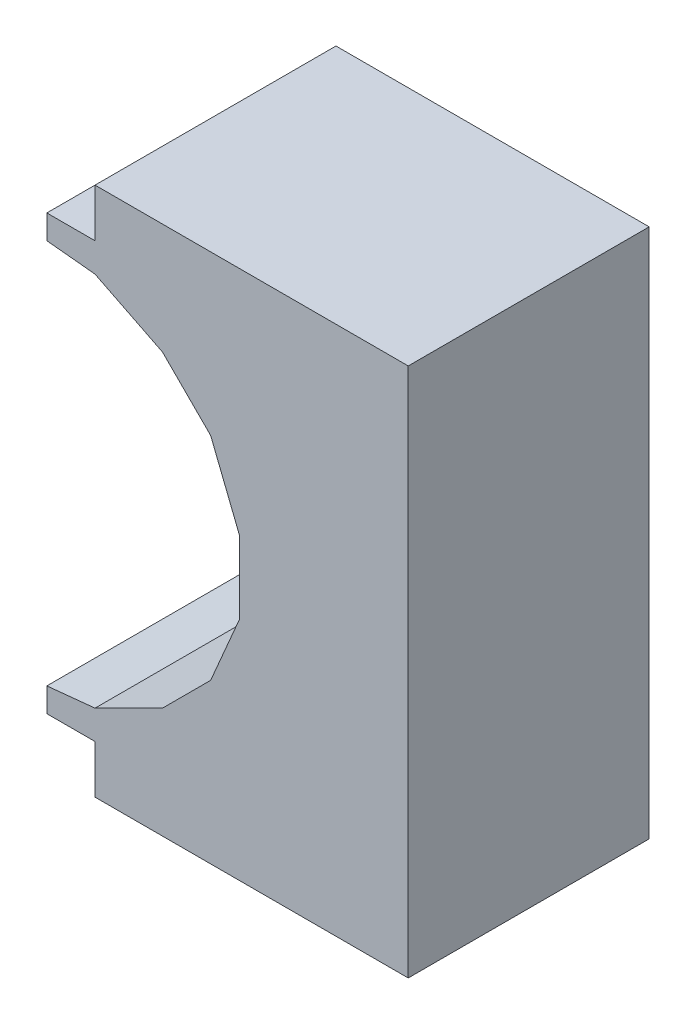
ISO-10303-21;
HEADER;
FILE_DESCRIPTION(('STEP AP214'),'2;1');
FILE_NAME('part.step','',(''),(''),'','','');
FILE_SCHEMA(('AUTOMOTIVE_DESIGN { 1 0 10303 214 1 1 1 1 }'));
ENDSEC;
DATA;
#1=APPLICATION_CONTEXT('core data for automotive mechanical design processes');
#2=APPLICATION_PROTOCOL_DEFINITION('international standard','automotive_design',2000,#1);
#3=PRODUCT_CONTEXT('',#1,'mechanical');
#4=PRODUCT('Part','Part','',(#3));
#5=PRODUCT_RELATED_PRODUCT_CATEGORY('part','',(#4));
#6=PRODUCT_DEFINITION_FORMATION('','',#4);
#7=PRODUCT_DEFINITION_CONTEXT('part definition',#1,'design');
#8=PRODUCT_DEFINITION('design','',#6,#7);
#9=PRODUCT_DEFINITION_SHAPE('','',#8);
#10=(LENGTH_UNIT() NAMED_UNIT(*) SI_UNIT(.MILLI.,.METRE.));
#11=(NAMED_UNIT(*) PLANE_ANGLE_UNIT() SI_UNIT($,.RADIAN.));
#12=(NAMED_UNIT(*) SI_UNIT($,.STERADIAN.) SOLID_ANGLE_UNIT());
#13=UNCERTAINTY_MEASURE_WITH_UNIT(LENGTH_MEASURE(1.E-05),#10,'distance_accuracy_value','');
#14=(GEOMETRIC_REPRESENTATION_CONTEXT(3) GLOBAL_UNCERTAINTY_ASSIGNED_CONTEXT((#13)) GLOBAL_UNIT_ASSIGNED_CONTEXT((#10,
#11,#12)) REPRESENTATION_CONTEXT('',''));
#15=CARTESIAN_POINT('',(0.,0.,0.));
#16=DIRECTION('',(0.,0.,1.));
#17=DIRECTION('',(1.,0.,0.));
#18=AXIS2_PLACEMENT_3D('',#15,#16,#17);
#19=CARTESIAN_POINT('',(-0.37499798,0.4499991,0.5));
#20=DIRECTION('',(0.,0.,-1.));
#21=DIRECTION('',(-1.,0.,0.));
#22=AXIS2_PLACEMENT_3D('',#19,#20,#21);
#23=PLANE('',#22);
#24=DIRECTION('',(0.995037190209989,-0.0995037190209989,0.));
#25=VECTOR('',#24,1.);
#26=CARTESIAN_POINT('',(-0.27499818,0.38999922,0.5));
#27=LINE('',#26,#25);
#28=CARTESIAN_POINT('',(-0.27499818,0.38999922,0.5));
#29=VERTEX_POINT('',#28);
#30=CARTESIAN_POINT('',(-0.37499798,0.3999992,0.5));
#31=VERTEX_POINT('',#30);
#32=EDGE_CURVE('E269',#29,#31,#27,.F.);
#33=ORIENTED_EDGE('',*,*,#32,.F.);
#34=DIRECTION('',(0.894427190999916,-0.447213595499958,0.));
#35=VECTOR('',#34,1.);
#36=CARTESIAN_POINT('',(-0.13499846,0.31999936,0.5));
#37=LINE('',#36,#35);
#38=CARTESIAN_POINT('',(-0.13499846,0.31999936,0.5));
#39=VERTEX_POINT('',#38);
#40=EDGE_CURVE('E262',#39,#29,#37,.F.);
#41=ORIENTED_EDGE('',*,*,#40,.F.);
#42=DIRECTION('',(0.707106781186548,-0.707106781186548,0.));
#43=VECTOR('',#42,1.);
#44=CARTESIAN_POINT('',(-0.03499866,0.21999956,0.5));
#45=LINE('',#44,#43);
#46=CARTESIAN_POINT('',(-0.03499866,0.21999956,0.5));
#47=VERTEX_POINT('',#46);
#48=EDGE_CURVE('E255',#47,#39,#45,.F.);
#49=ORIENTED_EDGE('',*,*,#48,.F.);
#50=DIRECTION('',(0.371390676354104,-0.928476690885259,0.));
#51=VECTOR('',#50,1.);
#52=CARTESIAN_POINT('',(0.02500122,0.06999986,0.5));
#53=LINE('',#52,#51);
#54=CARTESIAN_POINT('',(0.02500122,0.06999986,0.5));
#55=VERTEX_POINT('',#54);
#56=EDGE_CURVE('E248',#55,#47,#53,.F.);
#57=ORIENTED_EDGE('',*,*,#56,.F.);
#58=DIRECTION('',(0.,1.,0.));
#59=VECTOR('',#58,1.);
#60=CARTESIAN_POINT('',(0.02500122,-0.08000238,0.5));
#61=LINE('',#60,#59);
#62=CARTESIAN_POINT('',(0.0250012199999909,-0.080002379999996,0.5));
#63=VERTEX_POINT('',#62);
#64=EDGE_CURVE('E241',#63,#55,#61,.T.);
#65=ORIENTED_EDGE('',*,*,#64,.F.);
#66=DIRECTION('',(-0.393919298579047,-0.91914503001811,0.));
#67=VECTOR('',#66,1.);
#68=CARTESIAN_POINT('',(-0.03499866,-0.2200021,0.5));
#69=LINE('',#68,#67);
#70=CARTESIAN_POINT('',(-0.03499866,-0.2200021,0.5));
#71=VERTEX_POINT('',#70);
#72=EDGE_CURVE('E234',#71,#63,#69,.F.);
#73=ORIENTED_EDGE('',*,*,#72,.F.);
#74=DIRECTION('',(-0.707106781186548,-0.707106781186548,0.));
#75=VECTOR('',#74,1.);
#76=CARTESIAN_POINT('',(-0.13499846,-0.3200019,0.5));
#77=LINE('',#76,#75);
#78=CARTESIAN_POINT('',(-0.13499846,-0.3200019,0.5));
#79=VERTEX_POINT('',#78);
#80=EDGE_CURVE('E227',#79,#71,#77,.F.);
#81=ORIENTED_EDGE('',*,*,#80,.F.);
#82=DIRECTION('',(-0.894427190999916,-0.447213595499958,0.));
#83=VECTOR('',#82,1.);
#84=CARTESIAN_POINT('',(-0.27499818,-0.39000176,0.5));
#85=LINE('',#84,#83);
#86=CARTESIAN_POINT('',(-0.274998180000001,-0.390001759999997,0.5));
#87=VERTEX_POINT('',#86);
#88=EDGE_CURVE('E220',#87,#79,#85,.F.);
#89=ORIENTED_EDGE('',*,*,#88,.F.);
#90=DIRECTION('',(-0.995039692277377,-0.0994786951690777,0.));
#91=VECTOR('',#90,1.);
#92=CARTESIAN_POINT('',(-0.37499798,-0.3999992,0.5));
#93=LINE('',#92,#91);
#94=CARTESIAN_POINT('',(-0.37499798,-0.3999992,0.5));
#95=VERTEX_POINT('',#94);
#96=EDGE_CURVE('E213',#95,#87,#93,.F.);
#97=ORIENTED_EDGE('',*,*,#96,.F.);
#98=DIRECTION('',(0.,1.,0.));
#99=VECTOR('',#98,1.);
#100=CARTESIAN_POINT('',(-0.37499798,-0.45000164,0.5));
#101=LINE('',#100,#99);
#102=CARTESIAN_POINT('',(-0.37499798,-0.45000164,0.5));
#103=VERTEX_POINT('',#102);
#104=EDGE_CURVE('E206',#103,#95,#101,.T.);
#105=ORIENTED_EDGE('',*,*,#104,.F.);
#106=DIRECTION('',(1.,0.,0.));
#107=VECTOR('',#106,1.);
#108=CARTESIAN_POINT('',(-0.27499818,-0.45000164,0.5));
#109=LINE('',#108,#107);
#110=CARTESIAN_POINT('',(-0.27499818,-0.45000164,0.5));
#111=VERTEX_POINT('',#110);
#112=EDGE_CURVE('E199',#111,#103,#109,.F.);
#113=ORIENTED_EDGE('',*,*,#112,.F.);
#114=DIRECTION('',(0.,1.,0.));
#115=VECTOR('',#114,1.);
#116=CARTESIAN_POINT('',(-0.27499818,-0.55000144,0.5));
#117=LINE('',#116,#115);
#118=CARTESIAN_POINT('',(-0.27499818,-0.55000144,0.5));
#119=VERTEX_POINT('',#118);
#120=EDGE_CURVE('E192',#119,#111,#117,.T.);
#121=ORIENTED_EDGE('',*,*,#120,.F.);
#122=DIRECTION('',(1.,0.,0.));
#123=VECTOR('',#122,1.);
#124=CARTESIAN_POINT('',(0.37500052,-0.55000144,0.5));
#125=LINE('',#124,#123);
#126=CARTESIAN_POINT('',(0.37500052,-0.55000144,0.5));
#127=VERTEX_POINT('',#126);
#128=EDGE_CURVE('E185',#127,#119,#125,.F.);
#129=ORIENTED_EDGE('',*,*,#128,.F.);
#130=DIRECTION('',(0.,1.,0.));
#131=VECTOR('',#130,1.);
#132=CARTESIAN_POINT('',(0.37500052,0.55000144,0.5));
#133=LINE('',#132,#131);
#134=CARTESIAN_POINT('',(0.37500052,0.55000144,0.5));
#135=VERTEX_POINT('',#134);
#136=EDGE_CURVE('E178',#135,#127,#133,.F.);
#137=ORIENTED_EDGE('',*,*,#136,.F.);
#138=DIRECTION('',(1.,0.,0.));
#139=VECTOR('',#138,1.);
#140=CARTESIAN_POINT('',(-0.27499818,0.55000144,0.5));
#141=LINE('',#140,#139);
#142=CARTESIAN_POINT('',(-0.27499818,0.55000144,0.5));
#143=VERTEX_POINT('',#142);
#144=EDGE_CURVE('E155',#143,#135,#141,.T.);
#145=ORIENTED_EDGE('',*,*,#144,.F.);
#146=DIRECTION('',(0.,1.,0.));
#147=VECTOR('',#146,1.);
#148=CARTESIAN_POINT('',(-0.27499818,0.4499991,0.5));
#149=LINE('',#148,#147);
#150=CARTESIAN_POINT('',(-0.27499818,0.4499991,0.5));
#151=VERTEX_POINT('',#150);
#152=EDGE_CURVE('E139',#151,#143,#149,.T.);
#153=ORIENTED_EDGE('',*,*,#152,.F.);
#154=DIRECTION('',(1.,0.,0.));
#155=VECTOR('',#154,1.);
#156=CARTESIAN_POINT('',(-0.37499798,0.4499991,0.5));
#157=LINE('',#156,#155);
#158=CARTESIAN_POINT('',(-0.37499798,0.4499991,0.5));
#159=VERTEX_POINT('',#158);
#160=EDGE_CURVE('E19',#159,#151,#157,.T.);
#161=ORIENTED_EDGE('',*,*,#160,.F.);
#162=DIRECTION('',(0.,1.,0.));
#163=VECTOR('',#162,1.);
#164=CARTESIAN_POINT('',(-0.37499798,0.3999992,0.5));
#165=LINE('',#164,#163);
#166=EDGE_CURVE('E274',#31,#159,#165,.T.);
#167=ORIENTED_EDGE('',*,*,#166,.F.);
#168=EDGE_LOOP('',(#33,#41,#49,#57,#65,#73,#81,#89,#97,#105,#113,#121,#129,#137,#145,#153,#161,#167));
#169=FACE_BOUND('',#168,.T.);
#170=ADVANCED_FACE('F16',(#169),#23,.F.);
#171=CARTESIAN_POINT('',(-0.37499798,0.4499991,0.));
#172=DIRECTION('',(0.,1.,0.));
#173=DIRECTION('',(0.,0.,1.));
#174=AXIS2_PLACEMENT_3D('',#171,#172,#173);
#175=PLANE('',#174);
#176=DIRECTION('',(0.,0.,1.));
#177=VECTOR('',#176,1.);
#178=CARTESIAN_POINT('',(-0.27499818,0.4499991,0.));
#179=LINE('',#178,#177);
#180=CARTESIAN_POINT('',(-0.27499818,0.4499991,0.));
#181=VERTEX_POINT('',#180);
#182=EDGE_CURVE('E145',#181,#151,#179,.T.);
#183=ORIENTED_EDGE('',*,*,#182,.F.);
#184=DIRECTION('',(-1.,0.,0.));
#185=VECTOR('',#184,1.);
#186=CARTESIAN_POINT('',(-0.37499798,0.4499991,0.));
#187=LINE('',#186,#185);
#188=CARTESIAN_POINT('',(-0.37499798,0.4499991,0.));
#189=VERTEX_POINT('',#188);
#190=EDGE_CURVE('E279',#189,#181,#187,.F.);
#191=ORIENTED_EDGE('',*,*,#190,.F.);
#192=DIRECTION('',(0.,0.,1.));
#193=VECTOR('',#192,1.);
#194=CARTESIAN_POINT('',(-0.37499798,0.4499991,0.));
#195=LINE('',#194,#193);
#196=EDGE_CURVE('E148',#159,#189,#195,.F.);
#197=ORIENTED_EDGE('',*,*,#196,.F.);
#198=ORIENTED_EDGE('',*,*,#160,.T.);
#199=EDGE_LOOP('',(#183,#191,#197,#198));
#200=FACE_BOUND('',#199,.T.);
#201=ADVANCED_FACE('F144',(#200),#175,.T.);
#202=CARTESIAN_POINT('',(-0.27499818,0.4499991,0.));
#203=DIRECTION('',(-1.,0.,0.));
#204=DIRECTION('',(0.,0.,1.));
#205=AXIS2_PLACEMENT_3D('',#202,#203,#204);
#206=PLANE('',#205);
#207=DIRECTION('',(0.,0.,1.));
#208=VECTOR('',#207,1.);
#209=CARTESIAN_POINT('',(-0.27499818,0.55000144,0.));
#210=LINE('',#209,#208);
#211=CARTESIAN_POINT('',(-0.27499818,0.55000144,0.));
#212=VERTEX_POINT('',#211);
#213=EDGE_CURVE('E158',#212,#143,#210,.T.);
#214=ORIENTED_EDGE('',*,*,#213,.F.);
#215=DIRECTION('',(0.,1.,0.));
#216=VECTOR('',#215,1.);
#217=CARTESIAN_POINT('',(-0.27499818,0.4499991,0.));
#218=LINE('',#217,#216);
#219=EDGE_CURVE('E162',#181,#212,#218,.T.);
#220=ORIENTED_EDGE('',*,*,#219,.F.);
#221=ORIENTED_EDGE('',*,*,#182,.T.);
#222=ORIENTED_EDGE('',*,*,#152,.T.);
#223=EDGE_LOOP('',(#214,#220,#221,#222));
#224=FACE_BOUND('',#223,.T.);
#225=ADVANCED_FACE('F160',(#224),#206,.T.);
#226=CARTESIAN_POINT('',(-0.27499818,0.55000144,0.));
#227=DIRECTION('',(0.,1.,0.));
#228=DIRECTION('',(0.,0.,1.));
#229=AXIS2_PLACEMENT_3D('',#226,#227,#228);
#230=PLANE('',#229);
#231=DIRECTION('',(0.,0.,-1.));
#232=VECTOR('',#231,1.);
#233=CARTESIAN_POINT('',(0.37500052,0.55000144,0.));
#234=LINE('',#233,#232);
#235=CARTESIAN_POINT('',(0.37500052,0.55000144,0.));
#236=VERTEX_POINT('',#235);
#237=EDGE_CURVE('E174',#236,#135,#234,.F.);
#238=ORIENTED_EDGE('',*,*,#237,.F.);
#239=DIRECTION('',(-1.,0.,0.));
#240=VECTOR('',#239,1.);
#241=CARTESIAN_POINT('',(-0.37499798,0.55000144,0.));
#242=LINE('',#241,#240);
#243=EDGE_CURVE('E283',#212,#236,#242,.F.);
#244=ORIENTED_EDGE('',*,*,#243,.F.);
#245=ORIENTED_EDGE('',*,*,#213,.T.);
#246=ORIENTED_EDGE('',*,*,#144,.T.);
#247=EDGE_LOOP('',(#238,#244,#245,#246));
#248=FACE_BOUND('',#247,.T.);
#249=ADVANCED_FACE('F411',(#248),#230,.T.);
#250=CARTESIAN_POINT('',(0.37500052,0.55000144,0.));
#251=DIRECTION('',(1.,0.,0.));
#252=DIRECTION('',(0.,0.,-1.));
#253=AXIS2_PLACEMENT_3D('',#250,#251,#252);
#254=PLANE('',#253);
#255=DIRECTION('',(0.,0.,-1.));
#256=VECTOR('',#255,1.);
#257=CARTESIAN_POINT('',(0.37500052,-0.55000144,0.));
#258=LINE('',#257,#256);
#259=CARTESIAN_POINT('',(0.37500052,-0.55000144,0.));
#260=VERTEX_POINT('',#259);
#261=EDGE_CURVE('E181',#260,#127,#258,.F.);
#262=ORIENTED_EDGE('',*,*,#261,.F.);
#263=DIRECTION('',(0.,1.,0.));
#264=VECTOR('',#263,1.);
#265=CARTESIAN_POINT('',(0.37500052,0.4499991,0.));
#266=LINE('',#265,#264);
#267=EDGE_CURVE('E287',#236,#260,#266,.F.);
#268=ORIENTED_EDGE('',*,*,#267,.F.);
#269=ORIENTED_EDGE('',*,*,#237,.T.);
#270=ORIENTED_EDGE('',*,*,#136,.T.);
#271=EDGE_LOOP('',(#262,#268,#269,#270));
#272=FACE_BOUND('',#271,.T.);
#273=ADVANCED_FACE('F407',(#272),#254,.T.);
#274=CARTESIAN_POINT('',(0.37500052,-0.55000144,0.));
#275=DIRECTION('',(0.,-1.,0.));
#276=DIRECTION('',(0.,0.,-1.));
#277=AXIS2_PLACEMENT_3D('',#274,#275,#276);
#278=PLANE('',#277);
#279=DIRECTION('',(0.,0.,1.));
#280=VECTOR('',#279,1.);
#281=CARTESIAN_POINT('',(-0.27499818,-0.55000144,0.));
#282=LINE('',#281,#280);
#283=CARTESIAN_POINT('',(-0.27499818,-0.55000144,0.));
#284=VERTEX_POINT('',#283);
#285=EDGE_CURVE('E188',#284,#119,#282,.T.);
#286=ORIENTED_EDGE('',*,*,#285,.F.);
#287=DIRECTION('',(-1.,0.,0.));
#288=VECTOR('',#287,1.);
#289=CARTESIAN_POINT('',(-0.37499798,-0.55000144,0.));
#290=LINE('',#289,#288);
#291=EDGE_CURVE('E291',#260,#284,#290,.T.);
#292=ORIENTED_EDGE('',*,*,#291,.F.);
#293=ORIENTED_EDGE('',*,*,#261,.T.);
#294=ORIENTED_EDGE('',*,*,#128,.T.);
#295=EDGE_LOOP('',(#286,#292,#293,#294));
#296=FACE_BOUND('',#295,.T.);
#297=ADVANCED_FACE('F403',(#296),#278,.T.);
#298=CARTESIAN_POINT('',(-0.27499818,-0.55000144,0.));
#299=DIRECTION('',(-1.,0.,0.));
#300=DIRECTION('',(0.,0.,1.));
#301=AXIS2_PLACEMENT_3D('',#298,#299,#300);
#302=PLANE('',#301);
#303=DIRECTION('',(0.,0.,-1.));
#304=VECTOR('',#303,1.);
#305=CARTESIAN_POINT('',(-0.27499818,-0.45000164,0.));
#306=LINE('',#305,#304);
#307=CARTESIAN_POINT('',(-0.27499818,-0.45000164,0.));
#308=VERTEX_POINT('',#307);
#309=EDGE_CURVE('E195',#308,#111,#306,.F.);
#310=ORIENTED_EDGE('',*,*,#309,.F.);
#311=DIRECTION('',(0.,1.,0.));
#312=VECTOR('',#311,1.);
#313=CARTESIAN_POINT('',(-0.27499818,0.4499991,0.));
#314=LINE('',#313,#312);
#315=EDGE_CURVE('E295',#284,#308,#314,.T.);
#316=ORIENTED_EDGE('',*,*,#315,.F.);
#317=ORIENTED_EDGE('',*,*,#285,.T.);
#318=ORIENTED_EDGE('',*,*,#120,.T.);
#319=EDGE_LOOP('',(#310,#316,#317,#318));
#320=FACE_BOUND('',#319,.T.);
#321=ADVANCED_FACE('F399',(#320),#302,.T.);
#322=CARTESIAN_POINT('',(-0.27499818,-0.45000164,0.));
#323=DIRECTION('',(0.,-1.,0.));
#324=DIRECTION('',(0.,0.,-1.));
#325=AXIS2_PLACEMENT_3D('',#322,#323,#324);
#326=PLANE('',#325);
#327=DIRECTION('',(0.,0.,1.));
#328=VECTOR('',#327,1.);
#329=CARTESIAN_POINT('',(-0.37499798,-0.45000164,0.));
#330=LINE('',#329,#328);
#331=CARTESIAN_POINT('',(-0.37499798,-0.45000164,0.));
#332=VERTEX_POINT('',#331);
#333=EDGE_CURVE('E202',#332,#103,#330,.T.);
#334=ORIENTED_EDGE('',*,*,#333,.F.);
#335=DIRECTION('',(-1.,0.,0.));
#336=VECTOR('',#335,1.);
#337=CARTESIAN_POINT('',(-0.37499798,-0.45000164,0.));
#338=LINE('',#337,#336);
#339=EDGE_CURVE('E299',#308,#332,#338,.T.);
#340=ORIENTED_EDGE('',*,*,#339,.F.);
#341=ORIENTED_EDGE('',*,*,#309,.T.);
#342=ORIENTED_EDGE('',*,*,#112,.T.);
#343=EDGE_LOOP('',(#334,#340,#341,#342));
#344=FACE_BOUND('',#343,.T.);
#345=ADVANCED_FACE('F395',(#344),#326,.T.);
#346=CARTESIAN_POINT('',(-0.37499798,-0.45000164,0.));
#347=DIRECTION('',(-1.,0.,0.));
#348=DIRECTION('',(0.,0.,1.));
#349=AXIS2_PLACEMENT_3D('',#346,#347,#348);
#350=PLANE('',#349);
#351=DIRECTION('',(0.,0.,1.));
#352=VECTOR('',#351,1.);
#353=CARTESIAN_POINT('',(-0.37499798,-0.3999992,0.));
#354=LINE('',#353,#352);
#355=CARTESIAN_POINT('',(-0.37499798,-0.3999992,0.));
#356=VERTEX_POINT('',#355);
#357=EDGE_CURVE('E209',#356,#95,#354,.T.);
#358=ORIENTED_EDGE('',*,*,#357,.F.);
#359=DIRECTION('',(0.,1.,0.));
#360=VECTOR('',#359,1.);
#361=CARTESIAN_POINT('',(-0.37499798,0.4499991,0.));
#362=LINE('',#361,#360);
#363=EDGE_CURVE('E303',#332,#356,#362,.T.);
#364=ORIENTED_EDGE('',*,*,#363,.F.);
#365=ORIENTED_EDGE('',*,*,#333,.T.);
#366=ORIENTED_EDGE('',*,*,#104,.T.);
#367=EDGE_LOOP('',(#358,#364,#365,#366));
#368=FACE_BOUND('',#367,.T.);
#369=ADVANCED_FACE('F391',(#368),#350,.T.);
#370=CARTESIAN_POINT('',(-0.37499798,-0.3999992,0.));
#371=DIRECTION('',(-0.0994786951690777,0.995039692277377,0.));
#372=DIRECTION('',(-0.995039692277377,-0.0994786951690777,0.));
#373=AXIS2_PLACEMENT_3D('',#370,#371,#372);
#374=PLANE('',#373);
#375=DIRECTION('',(0.,0.,1.));
#376=VECTOR('',#375,1.);
#377=CARTESIAN_POINT('',(-0.27499818,-0.39000176,0.));
#378=LINE('',#377,#376);
#379=CARTESIAN_POINT('',(-0.274998180000001,-0.390001759999997,0.));
#380=VERTEX_POINT('',#379);
#381=EDGE_CURVE('E216',#380,#87,#378,.T.);
#382=ORIENTED_EDGE('',*,*,#381,.F.);
#383=DIRECTION('',(0.995039692277384,0.099478695169006,0.));
#384=VECTOR('',#383,1.);
#385=CARTESIAN_POINT('',(-0.37499798,-0.3999992,0.));
#386=LINE('',#385,#384);
#387=EDGE_CURVE('E307',#356,#380,#386,.T.);
#388=ORIENTED_EDGE('',*,*,#387,.F.);
#389=ORIENTED_EDGE('',*,*,#357,.T.);
#390=ORIENTED_EDGE('',*,*,#96,.T.);
#391=EDGE_LOOP('',(#382,#388,#389,#390));
#392=FACE_BOUND('',#391,.T.);
#393=ADVANCED_FACE('F387',(#392),#374,.T.);
#394=CARTESIAN_POINT('',(-0.27499818,-0.39000176,0.));
#395=DIRECTION('',(-0.447213595499958,0.894427190999916,0.));
#396=DIRECTION('',(-0.894427190999916,-0.447213595499958,0.));
#397=AXIS2_PLACEMENT_3D('',#394,#395,#396);
#398=PLANE('',#397);
#399=DIRECTION('',(0.,0.,1.));
#400=VECTOR('',#399,1.);
#401=CARTESIAN_POINT('',(-0.13499846,-0.3200019,0.));
#402=LINE('',#401,#400);
#403=CARTESIAN_POINT('',(-0.13499846,-0.3200019,0.));
#404=VERTEX_POINT('',#403);
#405=EDGE_CURVE('E223',#404,#79,#402,.T.);
#406=ORIENTED_EDGE('',*,*,#405,.F.);
#407=DIRECTION('',(0.894427190999916,0.447213595499959,0.));
#408=VECTOR('',#407,1.);
#409=CARTESIAN_POINT('',(-0.27499818,-0.39000176,0.));
#410=LINE('',#409,#408);
#411=EDGE_CURVE('E310',#380,#404,#410,.T.);
#412=ORIENTED_EDGE('',*,*,#411,.F.);
#413=ORIENTED_EDGE('',*,*,#381,.T.);
#414=ORIENTED_EDGE('',*,*,#88,.T.);
#415=EDGE_LOOP('',(#406,#412,#413,#414));
#416=FACE_BOUND('',#415,.T.);
#417=ADVANCED_FACE('F383',(#416),#398,.T.);
#418=CARTESIAN_POINT('',(-0.13499846,-0.3200019,0.));
#419=DIRECTION('',(-0.707106781186548,0.707106781186548,0.));
#420=DIRECTION('',(-0.707106781186548,-0.707106781186548,0.));
#421=AXIS2_PLACEMENT_3D('',#418,#419,#420);
#422=PLANE('',#421);
#423=DIRECTION('',(0.,0.,1.));
#424=VECTOR('',#423,1.);
#425=CARTESIAN_POINT('',(-0.03499866,-0.2200021,0.));
#426=LINE('',#425,#424);
#427=CARTESIAN_POINT('',(-0.03499866,-0.2200021,0.));
#428=VERTEX_POINT('',#427);
#429=EDGE_CURVE('E230',#428,#71,#426,.T.);
#430=ORIENTED_EDGE('',*,*,#429,.F.);
#431=DIRECTION('',(0.707106781186548,0.707106781186548,0.));
#432=VECTOR('',#431,1.);
#433=CARTESIAN_POINT('',(-0.13499846,-0.3200019,0.));
#434=LINE('',#433,#432);
#435=EDGE_CURVE('E314',#404,#428,#434,.T.);
#436=ORIENTED_EDGE('',*,*,#435,.F.);
#437=ORIENTED_EDGE('',*,*,#405,.T.);
#438=ORIENTED_EDGE('',*,*,#80,.T.);
#439=EDGE_LOOP('',(#430,#436,#437,#438));
#440=FACE_BOUND('',#439,.T.);
#441=ADVANCED_FACE('F379',(#440),#422,.T.);
#442=CARTESIAN_POINT('',(-0.03499866,-0.2200021,0.));
#443=DIRECTION('',(-0.91914503001811,0.393919298579047,0.));
#444=DIRECTION('',(-0.393919298579047,-0.91914503001811,0.));
#445=AXIS2_PLACEMENT_3D('',#442,#443,#444);
#446=PLANE('',#445);
#447=DIRECTION('',(0.,0.,1.));
#448=VECTOR('',#447,1.);
#449=CARTESIAN_POINT('',(0.02500122,-0.08000238,0.));
#450=LINE('',#449,#448);
#451=CARTESIAN_POINT('',(0.0250012199999909,-0.080002379999996,0.));
#452=VERTEX_POINT('',#451);
#453=EDGE_CURVE('E237',#452,#63,#450,.T.);
#454=ORIENTED_EDGE('',*,*,#453,.F.);
#455=DIRECTION('',(0.393919298579168,0.919145030018058,0.));
#456=VECTOR('',#455,1.);
#457=CARTESIAN_POINT('',(-0.03499866,-0.2200021,0.));
#458=LINE('',#457,#456);
#459=EDGE_CURVE('E318',#428,#452,#458,.T.);
#460=ORIENTED_EDGE('',*,*,#459,.F.);
#461=ORIENTED_EDGE('',*,*,#429,.T.);
#462=ORIENTED_EDGE('',*,*,#72,.T.);
#463=EDGE_LOOP('',(#454,#460,#461,#462));
#464=FACE_BOUND('',#463,.T.);
#465=ADVANCED_FACE('F375',(#464),#446,.T.);
#466=CARTESIAN_POINT('',(0.02500122,-0.08000238,0.));
#467=DIRECTION('',(-1.,0.,0.));
#468=DIRECTION('',(0.,0.,1.));
#469=AXIS2_PLACEMENT_3D('',#466,#467,#468);
#470=PLANE('',#469);
#471=DIRECTION('',(0.,0.,1.));
#472=VECTOR('',#471,1.);
#473=CARTESIAN_POINT('',(0.02500122,0.06999986,0.));
#474=LINE('',#473,#472);
#475=CARTESIAN_POINT('',(0.02500122,0.06999986,0.));
#476=VERTEX_POINT('',#475);
#477=EDGE_CURVE('E244',#476,#55,#474,.T.);
#478=ORIENTED_EDGE('',*,*,#477,.F.);
#479=DIRECTION('',(0.,1.,0.));
#480=VECTOR('',#479,1.);
#481=CARTESIAN_POINT('',(0.02500122,0.4499991,0.));
#482=LINE('',#481,#480);
#483=EDGE_CURVE('E322',#452,#476,#482,.T.);
#484=ORIENTED_EDGE('',*,*,#483,.F.);
#485=ORIENTED_EDGE('',*,*,#453,.T.);
#486=ORIENTED_EDGE('',*,*,#64,.T.);
#487=EDGE_LOOP('',(#478,#484,#485,#486));
#488=FACE_BOUND('',#487,.T.);
#489=ADVANCED_FACE('F371',(#488),#470,.T.);
#490=CARTESIAN_POINT('',(0.02500122,0.06999986,0.));
#491=DIRECTION('',(-0.928476690885259,-0.371390676354104,0.));
#492=DIRECTION('',(0.371390676354104,-0.928476690885259,0.));
#493=AXIS2_PLACEMENT_3D('',#490,#491,#492);
#494=PLANE('',#493);
#495=DIRECTION('',(0.,0.,1.));
#496=VECTOR('',#495,1.);
#497=CARTESIAN_POINT('',(-0.03499866,0.21999956,0.));
#498=LINE('',#497,#496);
#499=CARTESIAN_POINT('',(-0.03499866,0.21999956,0.));
#500=VERTEX_POINT('',#499);
#501=EDGE_CURVE('E251',#500,#47,#498,.T.);
#502=ORIENTED_EDGE('',*,*,#501,.F.);
#503=DIRECTION('',(-0.371390676354104,0.928476690885259,0.));
#504=VECTOR('',#503,1.);
#505=CARTESIAN_POINT('',(0.02500122,0.06999986,0.));
#506=LINE('',#505,#504);
#507=EDGE_CURVE('E326',#476,#500,#506,.T.);
#508=ORIENTED_EDGE('',*,*,#507,.F.);
#509=ORIENTED_EDGE('',*,*,#477,.T.);
#510=ORIENTED_EDGE('',*,*,#56,.T.);
#511=EDGE_LOOP('',(#502,#508,#509,#510));
#512=FACE_BOUND('',#511,.T.);
#513=ADVANCED_FACE('F367',(#512),#494,.T.);
#514=CARTESIAN_POINT('',(-0.03499866,0.21999956,0.));
#515=DIRECTION('',(-0.707106781186548,-0.707106781186548,0.));
#516=DIRECTION('',(0.707106781186548,-0.707106781186548,0.));
#517=AXIS2_PLACEMENT_3D('',#514,#515,#516);
#518=PLANE('',#517);
#519=DIRECTION('',(0.,0.,1.));
#520=VECTOR('',#519,1.);
#521=CARTESIAN_POINT('',(-0.13499846,0.31999936,0.));
#522=LINE('',#521,#520);
#523=CARTESIAN_POINT('',(-0.13499846,0.31999936,0.));
#524=VERTEX_POINT('',#523);
#525=EDGE_CURVE('E258',#524,#39,#522,.T.);
#526=ORIENTED_EDGE('',*,*,#525,.F.);
#527=DIRECTION('',(-0.707106781186547,0.707106781186548,0.));
#528=VECTOR('',#527,1.);
#529=CARTESIAN_POINT('',(-0.03499866,0.21999956,0.));
#530=LINE('',#529,#528);
#531=EDGE_CURVE('E330',#500,#524,#530,.T.);
#532=ORIENTED_EDGE('',*,*,#531,.F.);
#533=ORIENTED_EDGE('',*,*,#501,.T.);
#534=ORIENTED_EDGE('',*,*,#48,.T.);
#535=EDGE_LOOP('',(#526,#532,#533,#534));
#536=FACE_BOUND('',#535,.T.);
#537=ADVANCED_FACE('F364',(#536),#518,.T.);
#538=CARTESIAN_POINT('',(-0.13499846,0.31999936,0.));
#539=DIRECTION('',(-0.447213595499958,-0.894427190999916,0.));
#540=DIRECTION('',(0.894427190999916,-0.447213595499958,0.));
#541=AXIS2_PLACEMENT_3D('',#538,#539,#540);
#542=PLANE('',#541);
#543=DIRECTION('',(0.,0.,1.));
#544=VECTOR('',#543,1.);
#545=CARTESIAN_POINT('',(-0.27499818,0.38999922,0.));
#546=LINE('',#545,#544);
#547=CARTESIAN_POINT('',(-0.27499818,0.38999922,0.));
#548=VERTEX_POINT('',#547);
#549=EDGE_CURVE('E265',#548,#29,#546,.T.);
#550=ORIENTED_EDGE('',*,*,#549,.F.);
#551=DIRECTION('',(-0.894427190999916,0.447213595499958,0.));
#552=VECTOR('',#551,1.);
#553=CARTESIAN_POINT('',(-0.13499846,0.31999936,0.));
#554=LINE('',#553,#552);
#555=EDGE_CURVE('E334',#524,#548,#554,.T.);
#556=ORIENTED_EDGE('',*,*,#555,.F.);
#557=ORIENTED_EDGE('',*,*,#525,.T.);
#558=ORIENTED_EDGE('',*,*,#40,.T.);
#559=EDGE_LOOP('',(#550,#556,#557,#558));
#560=FACE_BOUND('',#559,.T.);
#561=ADVANCED_FACE('F346',(#560),#542,.T.);
#562=CARTESIAN_POINT('',(-0.27499818,0.38999922,0.));
#563=DIRECTION('',(-0.0995037190209989,-0.995037190209989,0.));
#564=DIRECTION('',(0.995037190209989,-0.0995037190209989,0.));
#565=AXIS2_PLACEMENT_3D('',#562,#563,#564);
#566=PLANE('',#565);
#567=DIRECTION('',(0.,0.,1.));
#568=VECTOR('',#567,1.);
#569=CARTESIAN_POINT('',(-0.37499798,0.3999992,0.));
#570=LINE('',#569,#568);
#571=CARTESIAN_POINT('',(-0.37499798,0.3999992,0.));
#572=VERTEX_POINT('',#571);
#573=EDGE_CURVE('E35',#572,#31,#570,.T.);
#574=ORIENTED_EDGE('',*,*,#573,.F.);
#575=DIRECTION('',(-0.995037190209989,0.0995037190209994,0.));
#576=VECTOR('',#575,1.);
#577=CARTESIAN_POINT('',(-0.27499818,0.38999922,0.));
#578=LINE('',#577,#576);
#579=EDGE_CURVE('E26',#548,#572,#578,.T.);
#580=ORIENTED_EDGE('',*,*,#579,.F.);
#581=ORIENTED_EDGE('',*,*,#549,.T.);
#582=ORIENTED_EDGE('',*,*,#32,.T.);
#583=EDGE_LOOP('',(#574,#580,#581,#582));
#584=FACE_BOUND('',#583,.T.);
#585=ADVANCED_FACE('F344',(#584),#566,.T.);
#586=CARTESIAN_POINT('',(-0.37499798,0.3999992,0.));
#587=DIRECTION('',(-1.,0.,0.));
#588=DIRECTION('',(0.,0.,1.));
#589=AXIS2_PLACEMENT_3D('',#586,#587,#588);
#590=PLANE('',#589);
#591=ORIENTED_EDGE('',*,*,#196,.T.);
#592=DIRECTION('',(0.,1.,0.));
#593=VECTOR('',#592,1.);
#594=CARTESIAN_POINT('',(-0.37499798,0.4499991,0.));
#595=LINE('',#594,#593);
#596=EDGE_CURVE('E11',#572,#189,#595,.T.);
#597=ORIENTED_EDGE('',*,*,#596,.F.);
#598=ORIENTED_EDGE('',*,*,#573,.T.);
#599=ORIENTED_EDGE('',*,*,#166,.T.);
#600=EDGE_LOOP('',(#591,#597,#598,#599));
#601=FACE_BOUND('',#600,.T.);
#602=ADVANCED_FACE('F350',(#601),#590,.T.);
#603=CARTESIAN_POINT('',(-0.37499798,0.4499991,0.));
#604=DIRECTION('',(0.,0.,-1.));
#605=DIRECTION('',(-1.,0.,0.));
#606=AXIS2_PLACEMENT_3D('',#603,#604,#605);
#607=PLANE('',#606);
#608=ORIENTED_EDGE('',*,*,#579,.T.);
#609=ORIENTED_EDGE('',*,*,#596,.T.);
#610=ORIENTED_EDGE('',*,*,#190,.T.);
#611=ORIENTED_EDGE('',*,*,#219,.T.);
#612=ORIENTED_EDGE('',*,*,#243,.T.);
#613=ORIENTED_EDGE('',*,*,#267,.T.);
#614=ORIENTED_EDGE('',*,*,#291,.T.);
#615=ORIENTED_EDGE('',*,*,#315,.T.);
#616=ORIENTED_EDGE('',*,*,#339,.T.);
#617=ORIENTED_EDGE('',*,*,#363,.T.);
#618=ORIENTED_EDGE('',*,*,#387,.T.);
#619=ORIENTED_EDGE('',*,*,#411,.T.);
#620=ORIENTED_EDGE('',*,*,#435,.T.);
#621=ORIENTED_EDGE('',*,*,#459,.T.);
#622=ORIENTED_EDGE('',*,*,#483,.T.);
#623=ORIENTED_EDGE('',*,*,#507,.T.);
#624=ORIENTED_EDGE('',*,*,#531,.T.);
#625=ORIENTED_EDGE('',*,*,#555,.T.);
#626=EDGE_LOOP('',(#608,#609,#610,#611,#612,#613,#614,#615,#616,#617,#618,#619,#620,#621,#622,
#623,#624,#625));
#627=FACE_BOUND('',#626,.T.);
#628=ADVANCED_FACE('F342',(#627),#607,.T.);
#629=CLOSED_SHELL('',(#170,#201,#225,#249,#273,#297,#321,#345,#369,#393,#417,#441,#465,#489,
#513,#537,#561,#585,#602,#628));
#630=MANIFOLD_SOLID_BREP('B1',#629);
#631=ADVANCED_BREP_SHAPE_REPRESENTATION('',(#18,#630),#14);
#632=SHAPE_DEFINITION_REPRESENTATION(#9,#631);
ENDSEC;
END-ISO-10303-21;
